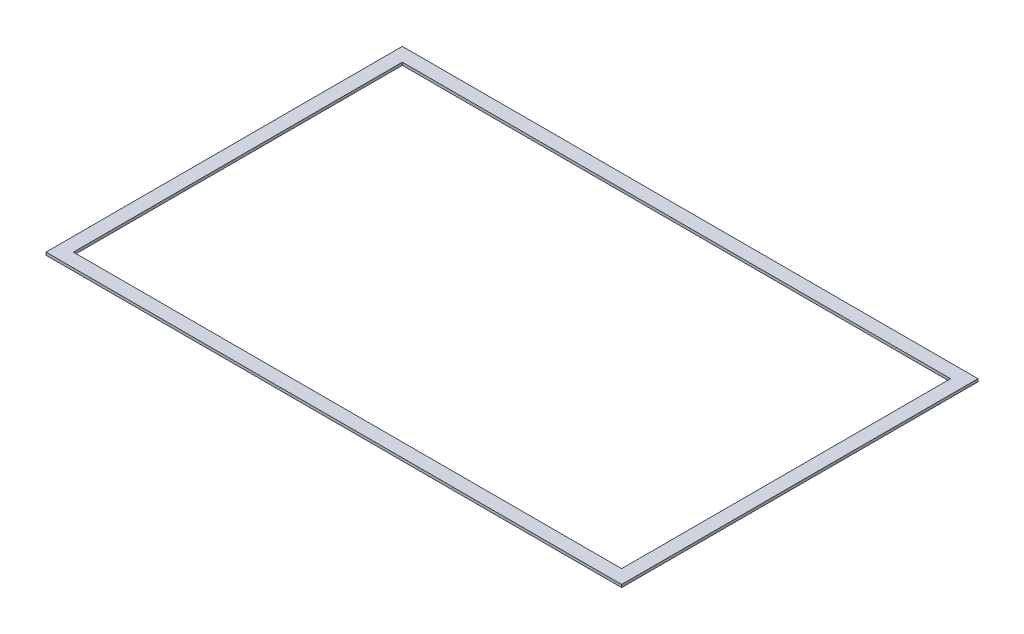
ISO-10303-21;
HEADER;
FILE_DESCRIPTION(('STEP AP214'),'2;1');
FILE_NAME('part.step','',(''),(''),'','','');
FILE_SCHEMA(('AUTOMOTIVE_DESIGN { 1 0 10303 214 1 1 1 1 }'));
ENDSEC;
DATA;
#1=APPLICATION_CONTEXT('core data for automotive mechanical design processes');
#2=APPLICATION_PROTOCOL_DEFINITION('international standard','automotive_design',2000,#1);
#3=PRODUCT_CONTEXT('',#1,'mechanical');
#4=PRODUCT('Part','Part','',(#3));
#5=PRODUCT_RELATED_PRODUCT_CATEGORY('part','',(#4));
#6=PRODUCT_DEFINITION_FORMATION('','',#4);
#7=PRODUCT_DEFINITION_CONTEXT('part definition',#1,'design');
#8=PRODUCT_DEFINITION('design','',#6,#7);
#9=PRODUCT_DEFINITION_SHAPE('','',#8);
#10=(LENGTH_UNIT() NAMED_UNIT(*) SI_UNIT(.MILLI.,.METRE.));
#11=(NAMED_UNIT(*) PLANE_ANGLE_UNIT() SI_UNIT($,.RADIAN.));
#12=(NAMED_UNIT(*) SI_UNIT($,.STERADIAN.) SOLID_ANGLE_UNIT());
#13=UNCERTAINTY_MEASURE_WITH_UNIT(LENGTH_MEASURE(1.E-05),#10,'distance_accuracy_value','');
#14=(GEOMETRIC_REPRESENTATION_CONTEXT(3) GLOBAL_UNCERTAINTY_ASSIGNED_CONTEXT((#13)) GLOBAL_UNIT_ASSIGNED_CONTEXT((#10,
#11,#12)) REPRESENTATION_CONTEXT('',''));
#15=CARTESIAN_POINT('',(0.,0.,0.));
#16=DIRECTION('',(0.,0.,1.));
#17=DIRECTION('',(1.,0.,0.));
#18=AXIS2_PLACEMENT_3D('',#15,#16,#17);
#19=CARTESIAN_POINT('',(0.,1.,0.));
#20=DIRECTION('',(0.,-1.,0.));
#21=DIRECTION('',(0.,0.,-1.));
#22=AXIS2_PLACEMENT_3D('',#19,#20,#21);
#23=PLANE('',#22);
#24=DIRECTION('',(0.,0.,-1.));
#25=VECTOR('',#24,1.);
#26=CARTESIAN_POINT('',(105.,1.,65.));
#27=LINE('',#26,#25);
#28=CARTESIAN_POINT('',(105.,1.,65.));
#29=VERTEX_POINT('',#28);
#30=CARTESIAN_POINT('',(105.,1.,-65.));
#31=VERTEX_POINT('',#30);
#32=EDGE_CURVE('E134',#29,#31,#27,.T.);
#33=ORIENTED_EDGE('',*,*,#32,.T.);
#34=DIRECTION('',(-1.,0.,0.));
#35=VECTOR('',#34,1.);
#36=CARTESIAN_POINT('',(-105.,1.,-65.));
#37=LINE('',#36,#35);
#38=CARTESIAN_POINT('',(-105.,1.,-65.));
#39=VERTEX_POINT('',#38);
#40=EDGE_CURVE('E137',#31,#39,#37,.T.);
#41=ORIENTED_EDGE('',*,*,#40,.T.);
#42=DIRECTION('',(0.,0.,1.));
#43=VECTOR('',#42,1.);
#44=CARTESIAN_POINT('',(-105.,1.,65.));
#45=LINE('',#44,#43);
#46=CARTESIAN_POINT('',(-105.,1.,65.));
#47=VERTEX_POINT('',#46);
#48=EDGE_CURVE('E140',#39,#47,#45,.T.);
#49=ORIENTED_EDGE('',*,*,#48,.T.);
#50=DIRECTION('',(1.,0.,0.));
#51=VECTOR('',#50,1.);
#52=CARTESIAN_POINT('',(-105.,1.,65.));
#53=LINE('',#52,#51);
#54=EDGE_CURVE('E142',#47,#29,#53,.T.);
#55=ORIENTED_EDGE('',*,*,#54,.T.);
#56=EDGE_LOOP('',(#33,#41,#49,#55));
#57=FACE_BOUND('',#56,.T.);
#58=DIRECTION('',(0.,0.,-1.));
#59=VECTOR('',#58,1.);
#60=CARTESIAN_POINT('',(100.,1.,60.));
#61=LINE('',#60,#59);
#62=CARTESIAN_POINT('',(100.,1.,60.));
#63=VERTEX_POINT('',#62);
#64=CARTESIAN_POINT('',(100.,1.,-60.));
#65=VERTEX_POINT('',#64);
#66=EDGE_CURVE('E98',#63,#65,#61,.T.);
#67=ORIENTED_EDGE('',*,*,#66,.F.);
#68=DIRECTION('',(1.,0.,0.));
#69=VECTOR('',#68,1.);
#70=CARTESIAN_POINT('',(-100.,1.,60.));
#71=LINE('',#70,#69);
#72=CARTESIAN_POINT('',(-100.,1.,60.));
#73=VERTEX_POINT('',#72);
#74=EDGE_CURVE('E120',#73,#63,#71,.T.);
#75=ORIENTED_EDGE('',*,*,#74,.F.);
#76=DIRECTION('',(0.,0.,1.));
#77=VECTOR('',#76,1.);
#78=CARTESIAN_POINT('',(-100.,1.,60.));
#79=LINE('',#78,#77);
#80=CARTESIAN_POINT('',(-100.,1.,-60.));
#81=VERTEX_POINT('',#80);
#82=EDGE_CURVE('E118',#81,#73,#79,.T.);
#83=ORIENTED_EDGE('',*,*,#82,.F.);
#84=DIRECTION('',(-1.,0.,0.));
#85=VECTOR('',#84,1.);
#86=CARTESIAN_POINT('',(-100.,1.,-60.));
#87=LINE('',#86,#85);
#88=EDGE_CURVE('E106',#65,#81,#87,.T.);
#89=ORIENTED_EDGE('',*,*,#88,.F.);
#90=EDGE_LOOP('',(#67,#75,#83,#89));
#91=FACE_BOUND('',#90,.T.);
#92=ADVANCED_FACE('F33',(#57,#91),#23,.F.);
#93=CARTESIAN_POINT('',(0.,0.,0.));
#94=DIRECTION('',(0.,-1.,0.));
#95=DIRECTION('',(0.,0.,-1.));
#96=AXIS2_PLACEMENT_3D('',#93,#94,#95);
#97=PLANE('',#96);
#98=DIRECTION('',(0.,0.,-1.));
#99=VECTOR('',#98,1.);
#100=CARTESIAN_POINT('',(105.,0.,65.));
#101=LINE('',#100,#99);
#102=CARTESIAN_POINT('',(105.,0.,65.));
#103=VERTEX_POINT('',#102);
#104=CARTESIAN_POINT('',(105.,0.,-65.));
#105=VERTEX_POINT('',#104);
#106=EDGE_CURVE('E114',#103,#105,#101,.T.);
#107=ORIENTED_EDGE('',*,*,#106,.F.);
#108=DIRECTION('',(1.,0.,0.));
#109=VECTOR('',#108,1.);
#110=CARTESIAN_POINT('',(-105.,0.,65.));
#111=LINE('',#110,#109);
#112=CARTESIAN_POINT('',(-105.,0.,65.));
#113=VERTEX_POINT('',#112);
#114=EDGE_CURVE('E138',#113,#103,#111,.T.);
#115=ORIENTED_EDGE('',*,*,#114,.F.);
#116=DIRECTION('',(0.,0.,1.));
#117=VECTOR('',#116,1.);
#118=CARTESIAN_POINT('',(-105.,0.,65.));
#119=LINE('',#118,#117);
#120=CARTESIAN_POINT('',(-105.,0.,-65.));
#121=VERTEX_POINT('',#120);
#122=EDGE_CURVE('E149',#121,#113,#119,.T.);
#123=ORIENTED_EDGE('',*,*,#122,.F.);
#124=DIRECTION('',(-1.,0.,0.));
#125=VECTOR('',#124,1.);
#126=CARTESIAN_POINT('',(-105.,0.,-65.));
#127=LINE('',#126,#125);
#128=EDGE_CURVE('E147',#105,#121,#127,.T.);
#129=ORIENTED_EDGE('',*,*,#128,.F.);
#130=EDGE_LOOP('',(#107,#115,#123,#129));
#131=FACE_BOUND('',#130,.T.);
#132=DIRECTION('',(1.,0.,0.));
#133=VECTOR('',#132,1.);
#134=CARTESIAN_POINT('',(-100.,0.,60.));
#135=LINE('',#134,#133);
#136=CARTESIAN_POINT('',(-100.,0.,60.));
#137=VERTEX_POINT('',#136);
#138=CARTESIAN_POINT('',(100.,0.,60.));
#139=VERTEX_POINT('',#138);
#140=EDGE_CURVE('E107',#137,#139,#135,.T.);
#141=ORIENTED_EDGE('',*,*,#140,.T.);
#142=DIRECTION('',(0.,0.,-1.));
#143=VECTOR('',#142,1.);
#144=CARTESIAN_POINT('',(100.,0.,60.));
#145=LINE('',#144,#143);
#146=CARTESIAN_POINT('',(100.,0.,-60.));
#147=VERTEX_POINT('',#146);
#148=EDGE_CURVE('E56',#139,#147,#145,.T.);
#149=ORIENTED_EDGE('',*,*,#148,.T.);
#150=DIRECTION('',(-1.,0.,0.));
#151=VECTOR('',#150,1.);
#152=CARTESIAN_POINT('',(-100.,0.,-60.));
#153=LINE('',#152,#151);
#154=CARTESIAN_POINT('',(-100.,0.,-60.));
#155=VERTEX_POINT('',#154);
#156=EDGE_CURVE('E113',#147,#155,#153,.T.);
#157=ORIENTED_EDGE('',*,*,#156,.T.);
#158=DIRECTION('',(0.,0.,1.));
#159=VECTOR('',#158,1.);
#160=CARTESIAN_POINT('',(-100.,0.,60.));
#161=LINE('',#160,#159);
#162=EDGE_CURVE('E126',#155,#137,#161,.T.);
#163=ORIENTED_EDGE('',*,*,#162,.T.);
#164=EDGE_LOOP('',(#141,#149,#157,#163));
#165=FACE_BOUND('',#164,.T.);
#166=ADVANCED_FACE('F167',(#131,#165),#97,.T.);
#167=CARTESIAN_POINT('',(105.,1.,65.));
#168=DIRECTION('',(-1.,0.,0.));
#169=DIRECTION('',(0.,0.,1.));
#170=AXIS2_PLACEMENT_3D('',#167,#168,#169);
#171=PLANE('',#170);
#172=ORIENTED_EDGE('',*,*,#106,.T.);
#173=DIRECTION('',(0.,-1.,0.));
#174=VECTOR('',#173,1.);
#175=CARTESIAN_POINT('',(105.,1.,-65.));
#176=LINE('',#175,#174);
#177=EDGE_CURVE('E11',#31,#105,#176,.T.);
#178=ORIENTED_EDGE('',*,*,#177,.F.);
#179=ORIENTED_EDGE('',*,*,#32,.F.);
#180=DIRECTION('',(0.,-1.,0.));
#181=VECTOR('',#180,1.);
#182=CARTESIAN_POINT('',(105.,1.,65.));
#183=LINE('',#182,#181);
#184=EDGE_CURVE('E144',#29,#103,#183,.T.);
#185=ORIENTED_EDGE('',*,*,#184,.T.);
#186=EDGE_LOOP('',(#172,#178,#179,#185));
#187=FACE_BOUND('',#186,.T.);
#188=ADVANCED_FACE('F35',(#187),#171,.F.);
#189=CARTESIAN_POINT('',(-105.,1.,-65.));
#190=DIRECTION('',(0.,0.,1.));
#191=DIRECTION('',(1.,0.,0.));
#192=AXIS2_PLACEMENT_3D('',#189,#190,#191);
#193=PLANE('',#192);
#194=ORIENTED_EDGE('',*,*,#128,.T.);
#195=DIRECTION('',(0.,-1.,0.));
#196=VECTOR('',#195,1.);
#197=CARTESIAN_POINT('',(-105.,1.,-65.));
#198=LINE('',#197,#196);
#199=EDGE_CURVE('E41',#39,#121,#198,.T.);
#200=ORIENTED_EDGE('',*,*,#199,.F.);
#201=ORIENTED_EDGE('',*,*,#40,.F.);
#202=ORIENTED_EDGE('',*,*,#177,.T.);
#203=EDGE_LOOP('',(#194,#200,#201,#202));
#204=FACE_BOUND('',#203,.T.);
#205=ADVANCED_FACE('F177',(#204),#193,.F.);
#206=CARTESIAN_POINT('',(-105.,1.,65.));
#207=DIRECTION('',(1.,0.,0.));
#208=DIRECTION('',(0.,0.,-1.));
#209=AXIS2_PLACEMENT_3D('',#206,#207,#208);
#210=PLANE('',#209);
#211=ORIENTED_EDGE('',*,*,#122,.T.);
#212=DIRECTION('',(0.,-1.,0.));
#213=VECTOR('',#212,1.);
#214=CARTESIAN_POINT('',(-105.,1.,65.));
#215=LINE('',#214,#213);
#216=EDGE_CURVE('E154',#47,#113,#215,.T.);
#217=ORIENTED_EDGE('',*,*,#216,.F.);
#218=ORIENTED_EDGE('',*,*,#48,.F.);
#219=ORIENTED_EDGE('',*,*,#199,.T.);
#220=EDGE_LOOP('',(#211,#217,#218,#219));
#221=FACE_BOUND('',#220,.T.);
#222=ADVANCED_FACE('F161',(#221),#210,.F.);
#223=CARTESIAN_POINT('',(-105.,1.,65.));
#224=DIRECTION('',(0.,0.,-1.));
#225=DIRECTION('',(-1.,0.,0.));
#226=AXIS2_PLACEMENT_3D('',#223,#224,#225);
#227=PLANE('',#226);
#228=ORIENTED_EDGE('',*,*,#114,.T.);
#229=ORIENTED_EDGE('',*,*,#184,.F.);
#230=ORIENTED_EDGE('',*,*,#54,.F.);
#231=ORIENTED_EDGE('',*,*,#216,.T.);
#232=EDGE_LOOP('',(#228,#229,#230,#231));
#233=FACE_BOUND('',#232,.T.);
#234=ADVANCED_FACE('F171',(#233),#227,.F.);
#235=CARTESIAN_POINT('',(100.,1.,60.));
#236=DIRECTION('',(-1.,0.,0.));
#237=DIRECTION('',(0.,0.,1.));
#238=AXIS2_PLACEMENT_3D('',#235,#236,#237);
#239=PLANE('',#238);
#240=ORIENTED_EDGE('',*,*,#148,.F.);
#241=DIRECTION('',(0.,-1.,0.));
#242=VECTOR('',#241,1.);
#243=CARTESIAN_POINT('',(100.,1.,60.));
#244=LINE('',#243,#242);
#245=EDGE_CURVE('E102',#63,#139,#244,.T.);
#246=ORIENTED_EDGE('',*,*,#245,.F.);
#247=ORIENTED_EDGE('',*,*,#66,.T.);
#248=DIRECTION('',(0.,-1.,0.));
#249=VECTOR('',#248,1.);
#250=CARTESIAN_POINT('',(100.,1.,-60.));
#251=LINE('',#250,#249);
#252=EDGE_CURVE('E101',#65,#147,#251,.T.);
#253=ORIENTED_EDGE('',*,*,#252,.T.);
#254=EDGE_LOOP('',(#240,#246,#247,#253));
#255=FACE_BOUND('',#254,.T.);
#256=ADVANCED_FACE('F100',(#255),#239,.T.);
#257=CARTESIAN_POINT('',(-100.,1.,-60.));
#258=DIRECTION('',(0.,0.,1.));
#259=DIRECTION('',(1.,0.,0.));
#260=AXIS2_PLACEMENT_3D('',#257,#258,#259);
#261=PLANE('',#260);
#262=ORIENTED_EDGE('',*,*,#156,.F.);
#263=ORIENTED_EDGE('',*,*,#252,.F.);
#264=ORIENTED_EDGE('',*,*,#88,.T.);
#265=DIRECTION('',(0.,-1.,0.));
#266=VECTOR('',#265,1.);
#267=CARTESIAN_POINT('',(-100.,1.,-60.));
#268=LINE('',#267,#266);
#269=EDGE_CURVE('E115',#81,#155,#268,.T.);
#270=ORIENTED_EDGE('',*,*,#269,.T.);
#271=EDGE_LOOP('',(#262,#263,#264,#270));
#272=FACE_BOUND('',#271,.T.);
#273=ADVANCED_FACE('F110',(#272),#261,.T.);
#274=CARTESIAN_POINT('',(-100.,1.,60.));
#275=DIRECTION('',(1.,0.,0.));
#276=DIRECTION('',(0.,0.,-1.));
#277=AXIS2_PLACEMENT_3D('',#274,#275,#276);
#278=PLANE('',#277);
#279=ORIENTED_EDGE('',*,*,#162,.F.);
#280=ORIENTED_EDGE('',*,*,#269,.F.);
#281=ORIENTED_EDGE('',*,*,#82,.T.);
#282=DIRECTION('',(0.,-1.,0.));
#283=VECTOR('',#282,1.);
#284=CARTESIAN_POINT('',(-100.,1.,60.));
#285=LINE('',#284,#283);
#286=EDGE_CURVE('E48',#73,#137,#285,.T.);
#287=ORIENTED_EDGE('',*,*,#286,.T.);
#288=EDGE_LOOP('',(#279,#280,#281,#287));
#289=FACE_BOUND('',#288,.T.);
#290=ADVANCED_FACE('F200',(#289),#278,.T.);
#291=CARTESIAN_POINT('',(-100.,1.,60.));
#292=DIRECTION('',(0.,0.,-1.));
#293=DIRECTION('',(-1.,0.,0.));
#294=AXIS2_PLACEMENT_3D('',#291,#292,#293);
#295=PLANE('',#294);
#296=ORIENTED_EDGE('',*,*,#140,.F.);
#297=ORIENTED_EDGE('',*,*,#286,.F.);
#298=ORIENTED_EDGE('',*,*,#74,.T.);
#299=ORIENTED_EDGE('',*,*,#245,.T.);
#300=EDGE_LOOP('',(#296,#297,#298,#299));
#301=FACE_BOUND('',#300,.T.);
#302=ADVANCED_FACE('F204',(#301),#295,.T.);
#303=CLOSED_SHELL('',(#92,#166,#188,#205,#222,#234,#256,#273,#290,#302));
#304=MANIFOLD_SOLID_BREP('B2',#303);
#305=ADVANCED_BREP_SHAPE_REPRESENTATION('',(#18,#304),#14);
#306=SHAPE_DEFINITION_REPRESENTATION(#9,#305);
ENDSEC;
END-ISO-10303-21;
